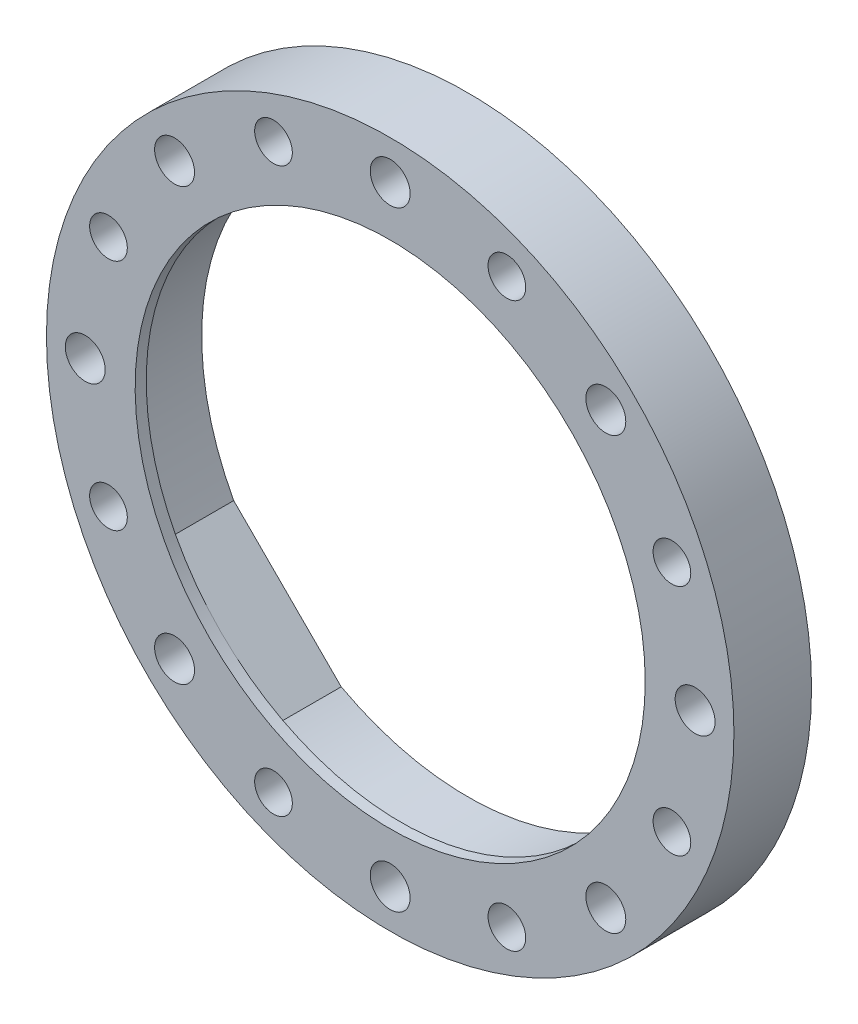
ISO-10303-21;
HEADER;
FILE_DESCRIPTION(('STEP AP214'),'2;1');
FILE_NAME('part.step','',(''),(''),'','','');
FILE_SCHEMA(('AUTOMOTIVE_DESIGN { 1 0 10303 214 1 1 1 1 }'));
ENDSEC;
DATA;
#1=APPLICATION_CONTEXT('core data for automotive mechanical design processes');
#2=APPLICATION_PROTOCOL_DEFINITION('international standard','automotive_design',2000,#1);
#3=PRODUCT_CONTEXT('',#1,'mechanical');
#4=PRODUCT('Part','Part','',(#3));
#5=PRODUCT_RELATED_PRODUCT_CATEGORY('part','',(#4));
#6=PRODUCT_DEFINITION_FORMATION('','',#4);
#7=PRODUCT_DEFINITION_CONTEXT('part definition',#1,'design');
#8=PRODUCT_DEFINITION('design','',#6,#7);
#9=PRODUCT_DEFINITION_SHAPE('','',#8);
#10=(LENGTH_UNIT() NAMED_UNIT(*) SI_UNIT(.MILLI.,.METRE.));
#11=(NAMED_UNIT(*) PLANE_ANGLE_UNIT() SI_UNIT($,.RADIAN.));
#12=(NAMED_UNIT(*) SI_UNIT($,.STERADIAN.) SOLID_ANGLE_UNIT());
#13=UNCERTAINTY_MEASURE_WITH_UNIT(LENGTH_MEASURE(1.E-05),#10,'distance_accuracy_value','');
#14=(GEOMETRIC_REPRESENTATION_CONTEXT(3) GLOBAL_UNCERTAINTY_ASSIGNED_CONTEXT((#13)) GLOBAL_UNIT_ASSIGNED_CONTEXT((#10,
#11,#12)) REPRESENTATION_CONTEXT('',''));
#15=CARTESIAN_POINT('',(0.,0.,0.));
#16=DIRECTION('',(0.,0.,1.));
#17=DIRECTION('',(1.,0.,0.));
#18=AXIS2_PLACEMENT_3D('',#15,#16,#17);
#19=CARTESIAN_POINT('',(0.,0.,0.));
#20=DIRECTION('',(0.,0.,1.));
#21=DIRECTION('',(1.,0.,0.));
#22=AXIS2_PLACEMENT_3D('',#19,#20,#21);
#23=CYLINDRICAL_SURFACE('',#22,24.);
#24=CARTESIAN_POINT('',(0.,0.,6.));
#25=DIRECTION('',(0.,0.,1.));
#26=DIRECTION('',(1.,0.,0.));
#27=AXIS2_PLACEMENT_3D('',#24,#25,#26);
#28=CIRCLE('',#27,24.);
#29=CARTESIAN_POINT('',(11.4157761098743,21.1111358247069,6.));
#30=VERTEX_POINT('',#29);
#31=CARTESIAN_POINT('',(-11.4157761098743,21.1111358247069,6.));
#32=VERTEX_POINT('',#31);
#33=EDGE_CURVE('E118',#30,#32,#28,.T.);
#34=ORIENTED_EDGE('',*,*,#33,.T.);
#35=DIRECTION('',(0.,0.,1.));
#36=VECTOR('',#35,1.);
#37=CARTESIAN_POINT('',(-11.4157761098743,21.1111358247069,0.));
#38=LINE('',#37,#36);
#39=CARTESIAN_POINT('',(-11.4157761098743,21.1111358247069,0.));
#40=VERTEX_POINT('',#39);
#41=EDGE_CURVE('E146',#40,#32,#38,.T.);
#42=ORIENTED_EDGE('',*,*,#41,.F.);
#43=CARTESIAN_POINT('',(0.,0.,0.));
#44=DIRECTION('',(0.,0.,1.));
#45=DIRECTION('',(1.,0.,0.));
#46=AXIS2_PLACEMENT_3D('',#43,#44,#45);
#47=CIRCLE('',#46,24.);
#48=CARTESIAN_POINT('',(11.4157761098743,21.1111358247069,0.));
#49=VERTEX_POINT('',#48);
#50=EDGE_CURVE('E190',#49,#40,#47,.T.);
#51=ORIENTED_EDGE('',*,*,#50,.F.);
#52=DIRECTION('',(0.,0.,1.));
#53=VECTOR('',#52,1.);
#54=CARTESIAN_POINT('',(11.4157761098743,21.1111358247069,0.));
#55=LINE('',#54,#53);
#56=EDGE_CURVE('E154',#49,#30,#55,.T.);
#57=ORIENTED_EDGE('',*,*,#56,.T.);
#58=EDGE_LOOP('',(#34,#42,#51,#57));
#59=FACE_BOUND('',#58,.T.);
#60=ADVANCED_FACE('F35',(#59),#23,.F.);
#61=CARTESIAN_POINT('',(21.1111358247069,-11.4157761098743,6.));
#62=VERTEX_POINT('',#61);
#63=CARTESIAN_POINT('',(21.1111358247069,11.4157761098743,6.));
#64=VERTEX_POINT('',#63);
#65=EDGE_CURVE('E187',#62,#64,#28,.T.);
#66=ORIENTED_EDGE('',*,*,#65,.T.);
#67=DIRECTION('',(0.,0.,1.));
#68=VECTOR('',#67,1.);
#69=CARTESIAN_POINT('',(21.1111358247069,11.4157761098743,0.));
#70=LINE('',#69,#68);
#71=CARTESIAN_POINT('',(21.1111358247069,11.4157761098743,0.));
#72=VERTEX_POINT('',#71);
#73=EDGE_CURVE('E144',#72,#64,#70,.T.);
#74=ORIENTED_EDGE('',*,*,#73,.F.);
#75=CARTESIAN_POINT('',(21.1111358247069,-11.4157761098742,0.));
#76=VERTEX_POINT('',#75);
#77=EDGE_CURVE('E183',#76,#72,#47,.T.);
#78=ORIENTED_EDGE('',*,*,#77,.F.);
#79=DIRECTION('',(0.,0.,1.));
#80=VECTOR('',#79,1.);
#81=CARTESIAN_POINT('',(21.1111358247069,-11.4157761098743,0.));
#82=LINE('',#81,#80);
#83=EDGE_CURVE('E163',#76,#62,#82,.T.);
#84=ORIENTED_EDGE('',*,*,#83,.T.);
#85=EDGE_LOOP('',(#66,#74,#78,#84));
#86=FACE_BOUND('',#85,.T.);
#87=ADVANCED_FACE('F200',(#86),#23,.F.);
#88=CARTESIAN_POINT('',(-21.1111358247069,11.4157761098743,0.));
#89=VERTEX_POINT('',#88);
#90=CARTESIAN_POINT('',(-21.1111358247069,-11.4157761098742,0.));
#91=VERTEX_POINT('',#90);
#92=EDGE_CURVE('E184',#89,#91,#47,.T.);
#93=ORIENTED_EDGE('',*,*,#92,.F.);
#94=DIRECTION('',(0.,0.,1.));
#95=VECTOR('',#94,1.);
#96=CARTESIAN_POINT('',(-21.1111358247069,11.4157761098743,0.));
#97=LINE('',#96,#95);
#98=CARTESIAN_POINT('',(-21.1111358247069,11.4157761098743,6.));
#99=VERTEX_POINT('',#98);
#100=EDGE_CURVE('E148',#89,#99,#97,.T.);
#101=ORIENTED_EDGE('',*,*,#100,.T.);
#102=CARTESIAN_POINT('',(-21.1111358247069,-11.4157761098742,6.));
#103=VERTEX_POINT('',#102);
#104=EDGE_CURVE('E179',#99,#103,#28,.T.);
#105=ORIENTED_EDGE('',*,*,#104,.T.);
#106=DIRECTION('',(0.,0.,1.));
#107=VECTOR('',#106,1.);
#108=CARTESIAN_POINT('',(-21.1111358247069,-11.4157761098743,0.));
#109=LINE('',#108,#107);
#110=EDGE_CURVE('E172',#91,#103,#109,.T.);
#111=ORIENTED_EDGE('',*,*,#110,.F.);
#112=EDGE_LOOP('',(#93,#101,#105,#111));
#113=FACE_BOUND('',#112,.T.);
#114=ADVANCED_FACE('F226',(#113),#23,.F.);
#115=DIRECTION('',(0.,0.,1.));
#116=VECTOR('',#115,1.);
#117=CARTESIAN_POINT('',(11.4157761098743,-21.1111358247069,0.));
#118=LINE('',#117,#116);
#119=CARTESIAN_POINT('',(11.4157761098743,-21.1111358247069,0.));
#120=VERTEX_POINT('',#119);
#121=CARTESIAN_POINT('',(11.4157761098743,-21.1111358247069,6.));
#122=VERTEX_POINT('',#121);
#123=EDGE_CURVE('E159',#120,#122,#118,.T.);
#124=ORIENTED_EDGE('',*,*,#123,.F.);
#125=CARTESIAN_POINT('',(-11.4157761098742,-21.1111358247069,0.));
#126=VERTEX_POINT('',#125);
#127=EDGE_CURVE('E43',#126,#120,#47,.T.);
#128=ORIENTED_EDGE('',*,*,#127,.F.);
#129=DIRECTION('',(0.,0.,1.));
#130=VECTOR('',#129,1.);
#131=CARTESIAN_POINT('',(-11.4157761098743,-21.1111358247069,0.));
#132=LINE('',#131,#130);
#133=CARTESIAN_POINT('',(-11.4157761098743,-21.1111358247069,6.));
#134=VERTEX_POINT('',#133);
#135=EDGE_CURVE('E176',#126,#134,#132,.T.);
#136=ORIENTED_EDGE('',*,*,#135,.T.);
#137=EDGE_CURVE('E185',#134,#122,#28,.T.);
#138=ORIENTED_EDGE('',*,*,#137,.T.);
#139=EDGE_LOOP('',(#124,#128,#136,#138));
#140=FACE_BOUND('',#139,.T.);
#141=ADVANCED_FACE('F205',(#140),#23,.F.);
#142=CARTESIAN_POINT('',(0.,0.,6.));
#143=DIRECTION('',(0.,0.,-1.));
#144=DIRECTION('',(-1.,0.,0.));
#145=AXIS2_PLACEMENT_3D('',#142,#143,#144);
#146=CYLINDRICAL_SURFACE('',#145,31.);
#147=CARTESIAN_POINT('',(0.,0.,0.));
#148=DIRECTION('',(0.,0.,1.));
#149=DIRECTION('',(1.,0.,0.));
#150=AXIS2_PLACEMENT_3D('',#147,#148,#149);
#151=CIRCLE('',#150,31.);
#152=CARTESIAN_POINT('',(31.,0.,0.));
#153=VERTEX_POINT('',#152);
#154=EDGE_CURVE('E11',#153,#153,#151,.T.);
#155=ORIENTED_EDGE('',*,*,#154,.T.);
#156=EDGE_LOOP('',(#155));
#157=FACE_BOUND('',#156,.T.);
#158=CARTESIAN_POINT('',(0.,0.,7.));
#159=DIRECTION('',(0.,0.,1.));
#160=DIRECTION('',(1.,0.,0.));
#161=AXIS2_PLACEMENT_3D('',#158,#159,#160);
#162=CIRCLE('',#161,31.);
#163=CARTESIAN_POINT('',(31.,0.,7.));
#164=VERTEX_POINT('',#163);
#165=EDGE_CURVE('E221',#164,#164,#162,.T.);
#166=ORIENTED_EDGE('',*,*,#165,.F.);
#167=EDGE_LOOP('',(#166));
#168=FACE_BOUND('',#167,.T.);
#169=ADVANCED_FACE('F37',(#157,#168),#146,.T.);
#170=CARTESIAN_POINT('',(0.,0.,0.));
#171=DIRECTION('',(0.,0.,1.));
#172=DIRECTION('',(1.,0.,0.));
#173=AXIS2_PLACEMENT_3D('',#170,#171,#172);
#174=PLANE('',#173);
#175=CARTESIAN_POINT('',(25.4066871440602,10.5237943900404,0.));
#176=DIRECTION('',(0.,0.,1.));
#177=DIRECTION('',(1.,0.,0.));
#178=AXIS2_PLACEMENT_3D('',#175,#176,#177);
#179=CIRCLE('',#178,1.7);
#180=CARTESIAN_POINT('',(27.1066871440602,10.5237943900404,0.));
#181=VERTEX_POINT('',#180);
#182=EDGE_CURVE('E341',#181,#181,#179,.T.);
#183=ORIENTED_EDGE('',*,*,#182,.T.);
#184=EDGE_LOOP('',(#183));
#185=FACE_BOUND('',#184,.T.);
#186=CARTESIAN_POINT('',(25.4066871440606,-10.5237943900395,0.));
#187=DIRECTION('',(0.,0.,1.));
#188=DIRECTION('',(1.,0.,0.));
#189=AXIS2_PLACEMENT_3D('',#186,#187,#188);
#190=CIRCLE('',#189,1.7);
#191=CARTESIAN_POINT('',(27.1066871440606,-10.5237943900395,0.));
#192=VERTEX_POINT('',#191);
#193=EDGE_CURVE('E351',#192,#192,#190,.T.);
#194=ORIENTED_EDGE('',*,*,#193,.T.);
#195=EDGE_LOOP('',(#194));
#196=FACE_BOUND('',#195,.T.);
#197=CARTESIAN_POINT('',(10.5237943900403,-25.4066871440602,0.));
#198=DIRECTION('',(0.,0.,1.));
#199=DIRECTION('',(1.,0.,0.));
#200=AXIS2_PLACEMENT_3D('',#197,#198,#199);
#201=CIRCLE('',#200,1.7);
#202=CARTESIAN_POINT('',(12.2237943900403,-25.4066871440602,0.));
#203=VERTEX_POINT('',#202);
#204=EDGE_CURVE('E357',#203,#203,#201,.T.);
#205=ORIENTED_EDGE('',*,*,#204,.T.);
#206=EDGE_LOOP('',(#205));
#207=FACE_BOUND('',#206,.T.);
#208=CARTESIAN_POINT('',(-10.5237943900398,-25.4066871440604,0.));
#209=DIRECTION('',(0.,0.,1.));
#210=DIRECTION('',(1.,0.,0.));
#211=AXIS2_PLACEMENT_3D('',#208,#209,#210);
#212=CIRCLE('',#211,1.7);
#213=CARTESIAN_POINT('',(-8.82379439003982,-25.4066871440604,0.));
#214=VERTEX_POINT('',#213);
#215=EDGE_CURVE('E363',#214,#214,#212,.T.);
#216=ORIENTED_EDGE('',*,*,#215,.T.);
#217=EDGE_LOOP('',(#216));
#218=FACE_BOUND('',#217,.T.);
#219=CARTESIAN_POINT('',(-25.4066871440603,-10.5237943900403,0.));
#220=DIRECTION('',(0.,0.,1.));
#221=DIRECTION('',(1.,0.,0.));
#222=AXIS2_PLACEMENT_3D('',#219,#220,#221);
#223=CIRCLE('',#222,1.7);
#224=CARTESIAN_POINT('',(-23.7066871440603,-10.5237943900403,0.));
#225=VERTEX_POINT('',#224);
#226=EDGE_CURVE('E369',#225,#225,#223,.T.);
#227=ORIENTED_EDGE('',*,*,#226,.T.);
#228=EDGE_LOOP('',(#227));
#229=FACE_BOUND('',#228,.T.);
#230=CARTESIAN_POINT('',(-25.4066871440605,10.5237943900397,0.));
#231=DIRECTION('',(0.,0.,1.));
#232=DIRECTION('',(1.,0.,0.));
#233=AXIS2_PLACEMENT_3D('',#230,#231,#232);
#234=CIRCLE('',#233,1.7);
#235=CARTESIAN_POINT('',(-23.7066871440605,10.5237943900397,0.));
#236=VERTEX_POINT('',#235);
#237=EDGE_CURVE('E375',#236,#236,#234,.T.);
#238=ORIENTED_EDGE('',*,*,#237,.T.);
#239=EDGE_LOOP('',(#238));
#240=FACE_BOUND('',#239,.T.);
#241=CARTESIAN_POINT('',(-10.5237943900402,25.4066871440603,0.));
#242=DIRECTION('',(0.,0.,1.));
#243=DIRECTION('',(1.,0.,0.));
#244=AXIS2_PLACEMENT_3D('',#241,#242,#243);
#245=CIRCLE('',#244,1.7);
#246=CARTESIAN_POINT('',(-8.82379439004017,25.4066871440603,0.));
#247=VERTEX_POINT('',#246);
#248=EDGE_CURVE('E381',#247,#247,#245,.T.);
#249=ORIENTED_EDGE('',*,*,#248,.T.);
#250=EDGE_LOOP('',(#249));
#251=FACE_BOUND('',#250,.T.);
#252=CARTESIAN_POINT('',(10.5237943900398,25.4066871440604,0.));
#253=DIRECTION('',(0.,0.,1.));
#254=DIRECTION('',(1.,0.,0.));
#255=AXIS2_PLACEMENT_3D('',#252,#253,#254);
#256=CIRCLE('',#255,1.7);
#257=CARTESIAN_POINT('',(12.2237943900398,25.4066871440604,0.));
#258=VERTEX_POINT('',#257);
#259=EDGE_CURVE('E387',#258,#258,#256,.T.);
#260=ORIENTED_EDGE('',*,*,#259,.T.);
#261=EDGE_LOOP('',(#260));
#262=FACE_BOUND('',#261,.T.);
#263=CARTESIAN_POINT('',(19.4454364826298,19.4454364826303,0.));
#264=DIRECTION('',(0.,0.,1.));
#265=DIRECTION('',(1.,0.,0.));
#266=AXIS2_PLACEMENT_3D('',#263,#264,#265);
#267=CIRCLE('',#266,1.8);
#268=CARTESIAN_POINT('',(21.2454364826298,19.4454364826303,0.));
#269=VERTEX_POINT('',#268);
#270=EDGE_CURVE('E393',#269,#269,#267,.T.);
#271=ORIENTED_EDGE('',*,*,#270,.T.);
#272=EDGE_LOOP('',(#271));
#273=FACE_BOUND('',#272,.T.);
#274=CARTESIAN_POINT('',(27.5,2.88047210454558E-13,0.));
#275=DIRECTION('',(0.,0.,1.));
#276=DIRECTION('',(1.,0.,0.));
#277=AXIS2_PLACEMENT_3D('',#274,#275,#276);
#278=CIRCLE('',#277,1.8);
#279=CARTESIAN_POINT('',(29.3,2.88047210454558E-13,0.));
#280=VERTEX_POINT('',#279);
#281=EDGE_CURVE('E399',#280,#280,#278,.T.);
#282=ORIENTED_EDGE('',*,*,#281,.T.);
#283=EDGE_LOOP('',(#282));
#284=FACE_BOUND('',#283,.T.);
#285=CARTESIAN_POINT('',(19.4454364826302,-19.4454364826299,0.));
#286=DIRECTION('',(0.,0.,1.));
#287=DIRECTION('',(1.,0.,0.));
#288=AXIS2_PLACEMENT_3D('',#285,#286,#287);
#289=CIRCLE('',#288,1.8);
#290=CARTESIAN_POINT('',(21.2454364826302,-19.4454364826299,0.));
#291=VERTEX_POINT('',#290);
#292=EDGE_CURVE('E405',#291,#291,#289,.T.);
#293=ORIENTED_EDGE('',*,*,#292,.T.);
#294=EDGE_LOOP('',(#293));
#295=FACE_BOUND('',#294,.T.);
#296=CARTESIAN_POINT('',(0.,-27.5,0.));
#297=DIRECTION('',(0.,0.,1.));
#298=DIRECTION('',(1.,0.,0.));
#299=AXIS2_PLACEMENT_3D('',#296,#297,#298);
#300=CIRCLE('',#299,1.8);
#301=CARTESIAN_POINT('',(1.8,-27.5,0.));
#302=VERTEX_POINT('',#301);
#303=EDGE_CURVE('E411',#302,#302,#300,.T.);
#304=ORIENTED_EDGE('',*,*,#303,.T.);
#305=EDGE_LOOP('',(#304));
#306=FACE_BOUND('',#305,.T.);
#307=CARTESIAN_POINT('',(-19.44543648263,-19.4454364826302,0.));
#308=DIRECTION('',(0.,0.,1.));
#309=DIRECTION('',(1.,0.,0.));
#310=AXIS2_PLACEMENT_3D('',#307,#308,#309);
#311=CIRCLE('',#310,1.8);
#312=CARTESIAN_POINT('',(-17.64543648263,-19.4454364826302,0.));
#313=VERTEX_POINT('',#312);
#314=EDGE_CURVE('E417',#313,#313,#311,.T.);
#315=ORIENTED_EDGE('',*,*,#314,.T.);
#316=EDGE_LOOP('',(#315));
#317=FACE_BOUND('',#316,.T.);
#318=CARTESIAN_POINT('',(-27.5,0.,0.));
#319=DIRECTION('',(0.,0.,1.));
#320=DIRECTION('',(1.,0.,0.));
#321=AXIS2_PLACEMENT_3D('',#318,#319,#320);
#322=CIRCLE('',#321,1.8);
#323=CARTESIAN_POINT('',(-25.7,0.,0.));
#324=VERTEX_POINT('',#323);
#325=EDGE_CURVE('E423',#324,#324,#322,.T.);
#326=ORIENTED_EDGE('',*,*,#325,.T.);
#327=EDGE_LOOP('',(#326));
#328=FACE_BOUND('',#327,.T.);
#329=CARTESIAN_POINT('',(-19.4454364826301,19.44543648263,0.));
#330=DIRECTION('',(0.,0.,1.));
#331=DIRECTION('',(1.,0.,0.));
#332=AXIS2_PLACEMENT_3D('',#329,#330,#331);
#333=CIRCLE('',#332,1.8);
#334=CARTESIAN_POINT('',(-17.6454364826301,19.44543648263,0.));
#335=VERTEX_POINT('',#334);
#336=EDGE_CURVE('E429',#335,#335,#333,.T.);
#337=ORIENTED_EDGE('',*,*,#336,.T.);
#338=EDGE_LOOP('',(#337));
#339=FACE_BOUND('',#338,.T.);
#340=CARTESIAN_POINT('',(0.,27.5,0.));
#341=DIRECTION('',(0.,0.,1.));
#342=DIRECTION('',(1.,0.,0.));
#343=AXIS2_PLACEMENT_3D('',#340,#341,#342);
#344=CIRCLE('',#343,1.8);
#345=CARTESIAN_POINT('',(1.8,27.5,0.));
#346=VERTEX_POINT('',#345);
#347=EDGE_CURVE('E135',#346,#346,#344,.T.);
#348=ORIENTED_EDGE('',*,*,#347,.T.);
#349=EDGE_LOOP('',(#348));
#350=FACE_BOUND('',#349,.T.);
#351=ORIENTED_EDGE('',*,*,#127,.T.);
#352=DIRECTION('',(0.707106781186548,0.707106781186548,0.));
#353=VECTOR('',#352,1.);
#354=CARTESIAN_POINT('',(16.2634559672906,-16.2634559672906,0.));
#355=LINE('',#354,#353);
#356=EDGE_CURVE('E156',#120,#76,#355,.T.);
#357=ORIENTED_EDGE('',*,*,#356,.T.);
#358=ORIENTED_EDGE('',*,*,#77,.T.);
#359=DIRECTION('',(0.707106781186548,-0.707106781186548,0.));
#360=VECTOR('',#359,1.);
#361=CARTESIAN_POINT('',(16.2634559672906,16.2634559672906,0.));
#362=LINE('',#361,#360);
#363=EDGE_CURVE('E56',#49,#72,#362,.T.);
#364=ORIENTED_EDGE('',*,*,#363,.F.);
#365=ORIENTED_EDGE('',*,*,#50,.T.);
#366=DIRECTION('',(0.707106781186548,0.707106781186548,0.));
#367=VECTOR('',#366,1.);
#368=CARTESIAN_POINT('',(-16.2634559672906,16.2634559672906,0.));
#369=LINE('',#368,#367);
#370=EDGE_CURVE('E50',#89,#40,#369,.T.);
#371=ORIENTED_EDGE('',*,*,#370,.F.);
#372=ORIENTED_EDGE('',*,*,#92,.T.);
#373=DIRECTION('',(0.707106781186548,-0.707106781186548,0.));
#374=VECTOR('',#373,1.);
#375=CARTESIAN_POINT('',(-16.2634559672906,-16.2634559672906,0.));
#376=LINE('',#375,#374);
#377=EDGE_CURVE('E169',#91,#126,#376,.T.);
#378=ORIENTED_EDGE('',*,*,#377,.T.);
#379=EDGE_LOOP('',(#351,#357,#358,#364,#365,#371,#372,#378));
#380=FACE_BOUND('',#379,.T.);
#381=ORIENTED_EDGE('',*,*,#154,.F.);
#382=EDGE_LOOP('',(#381));
#383=FACE_BOUND('',#382,.T.);
#384=ADVANCED_FACE('F201',(#185,#196,#207,#218,#229,#240,#251,#262,#273,#284,#295,#306,#317,
#328,#339,#350,#380,#383),#174,.F.);
#385=CARTESIAN_POINT('',(-16.2634559672906,-16.2634559672906,0.));
#386=DIRECTION('',(-0.707106781186547,-0.707106781186547,0.));
#387=DIRECTION('',(0.707106781186548,-0.707106781186548,0.));
#388=AXIS2_PLACEMENT_3D('',#385,#386,#387);
#389=PLANE('',#388);
#390=DIRECTION('',(0.707106781186548,-0.707106781186548,0.));
#391=VECTOR('',#390,1.);
#392=CARTESIAN_POINT('',(-16.2634559672906,-16.2634559672906,6.));
#393=LINE('',#392,#391);
#394=CARTESIAN_POINT('',(-16.2634559672906,-16.2634559672906,6.));
#395=VERTEX_POINT('',#394);
#396=EDGE_CURVE('E173',#103,#395,#393,.T.);
#397=ORIENTED_EDGE('',*,*,#396,.T.);
#398=EDGE_CURVE('E166',#395,#134,#393,.T.);
#399=ORIENTED_EDGE('',*,*,#398,.T.);
#400=ORIENTED_EDGE('',*,*,#135,.F.);
#401=ORIENTED_EDGE('',*,*,#377,.F.);
#402=ORIENTED_EDGE('',*,*,#110,.T.);
#403=EDGE_LOOP('',(#397,#399,#400,#401,#402));
#404=FACE_BOUND('',#403,.T.);
#405=ADVANCED_FACE('F211',(#404),#389,.F.);
#406=CARTESIAN_POINT('',(16.2634559672906,-16.2634559672906,0.));
#407=DIRECTION('',(0.707106781186547,-0.707106781186547,0.));
#408=DIRECTION('',(0.707106781186548,0.707106781186548,0.));
#409=AXIS2_PLACEMENT_3D('',#406,#407,#408);
#410=PLANE('',#409);
#411=DIRECTION('',(0.707106781186548,0.707106781186548,0.));
#412=VECTOR('',#411,1.);
#413=CARTESIAN_POINT('',(16.2634559672906,-16.2634559672906,6.));
#414=LINE('',#413,#412);
#415=CARTESIAN_POINT('',(16.2634559672906,-16.2634559672906,6.));
#416=VERTEX_POINT('',#415);
#417=EDGE_CURVE('E160',#122,#416,#414,.T.);
#418=ORIENTED_EDGE('',*,*,#417,.T.);
#419=EDGE_CURVE('E130',#416,#62,#414,.T.);
#420=ORIENTED_EDGE('',*,*,#419,.T.);
#421=ORIENTED_EDGE('',*,*,#83,.F.);
#422=ORIENTED_EDGE('',*,*,#356,.F.);
#423=ORIENTED_EDGE('',*,*,#123,.T.);
#424=EDGE_LOOP('',(#418,#420,#421,#422,#423));
#425=FACE_BOUND('',#424,.T.);
#426=ADVANCED_FACE('F204',(#425),#410,.F.);
#427=CARTESIAN_POINT('',(16.2634559672906,16.2634559672906,0.));
#428=DIRECTION('',(-0.707106781186547,-0.707106781186547,0.));
#429=DIRECTION('',(0.707106781186548,-0.707106781186548,0.));
#430=AXIS2_PLACEMENT_3D('',#427,#428,#429);
#431=PLANE('',#430);
#432=DIRECTION('',(0.707106781186548,-0.707106781186548,0.));
#433=VECTOR('',#432,1.);
#434=CARTESIAN_POINT('',(16.2634559672906,16.2634559672906,6.));
#435=LINE('',#434,#433);
#436=CARTESIAN_POINT('',(16.2634559672906,16.2634559672906,6.));
#437=VERTEX_POINT('',#436);
#438=EDGE_CURVE('E111',#30,#437,#435,.T.);
#439=ORIENTED_EDGE('',*,*,#438,.F.);
#440=ORIENTED_EDGE('',*,*,#56,.F.);
#441=ORIENTED_EDGE('',*,*,#363,.T.);
#442=ORIENTED_EDGE('',*,*,#73,.T.);
#443=EDGE_CURVE('E122',#437,#64,#435,.T.);
#444=ORIENTED_EDGE('',*,*,#443,.F.);
#445=EDGE_LOOP('',(#439,#440,#441,#442,#444));
#446=FACE_BOUND('',#445,.T.);
#447=ADVANCED_FACE('F142',(#446),#431,.T.);
#448=CARTESIAN_POINT('',(-16.2634559672906,16.2634559672906,0.));
#449=DIRECTION('',(0.707106781186547,-0.707106781186547,0.));
#450=DIRECTION('',(0.707106781186548,0.707106781186548,0.));
#451=AXIS2_PLACEMENT_3D('',#448,#449,#450);
#452=PLANE('',#451);
#453=DIRECTION('',(0.707106781186548,0.707106781186548,0.));
#454=VECTOR('',#453,1.);
#455=CARTESIAN_POINT('',(-16.2634559672906,16.2634559672906,6.));
#456=LINE('',#455,#454);
#457=CARTESIAN_POINT('',(-16.2634559672906,16.2634559672906,6.));
#458=VERTEX_POINT('',#457);
#459=EDGE_CURVE('E217',#99,#458,#456,.T.);
#460=ORIENTED_EDGE('',*,*,#459,.F.);
#461=ORIENTED_EDGE('',*,*,#100,.F.);
#462=ORIENTED_EDGE('',*,*,#370,.T.);
#463=ORIENTED_EDGE('',*,*,#41,.T.);
#464=EDGE_CURVE('E224',#458,#32,#456,.T.);
#465=ORIENTED_EDGE('',*,*,#464,.F.);
#466=EDGE_LOOP('',(#460,#461,#462,#463,#465));
#467=FACE_BOUND('',#466,.T.);
#468=ADVANCED_FACE('F228',(#467),#452,.T.);
#469=CARTESIAN_POINT('',(0.,0.,6.));
#470=DIRECTION('',(0.,0.,1.));
#471=DIRECTION('',(1.,0.,0.));
#472=AXIS2_PLACEMENT_3D('',#469,#470,#471);
#473=PLANE('',#472);
#474=ORIENTED_EDGE('',*,*,#398,.F.);
#475=CARTESIAN_POINT('',(0.,0.,6.));
#476=DIRECTION('',(0.,0.,1.));
#477=DIRECTION('',(1.,0.,0.));
#478=AXIS2_PLACEMENT_3D('',#475,#476,#477);
#479=CIRCLE('',#478,23.);
#480=EDGE_CURVE('E134',#395,#416,#479,.T.);
#481=ORIENTED_EDGE('',*,*,#480,.T.);
#482=ORIENTED_EDGE('',*,*,#417,.F.);
#483=ORIENTED_EDGE('',*,*,#137,.F.);
#484=EDGE_LOOP('',(#474,#481,#482,#483));
#485=FACE_BOUND('',#484,.T.);
#486=ADVANCED_FACE('F213',(#485),#473,.F.);
#487=ORIENTED_EDGE('',*,*,#396,.F.);
#488=ORIENTED_EDGE('',*,*,#104,.F.);
#489=ORIENTED_EDGE('',*,*,#459,.T.);
#490=EDGE_CURVE('E140',#458,#395,#479,.T.);
#491=ORIENTED_EDGE('',*,*,#490,.T.);
#492=EDGE_LOOP('',(#487,#488,#489,#491));
#493=FACE_BOUND('',#492,.T.);
#494=ADVANCED_FACE('F215',(#493),#473,.F.);
#495=EDGE_CURVE('E115',#437,#458,#479,.T.);
#496=ORIENTED_EDGE('',*,*,#495,.T.);
#497=ORIENTED_EDGE('',*,*,#464,.T.);
#498=ORIENTED_EDGE('',*,*,#33,.F.);
#499=ORIENTED_EDGE('',*,*,#438,.T.);
#500=EDGE_LOOP('',(#496,#497,#498,#499));
#501=FACE_BOUND('',#500,.T.);
#502=ADVANCED_FACE('F113',(#501),#473,.F.);
#503=CARTESIAN_POINT('',(0.,0.,7.));
#504=DIRECTION('',(0.,0.,1.));
#505=DIRECTION('',(1.,0.,0.));
#506=AXIS2_PLACEMENT_3D('',#503,#504,#505);
#507=PLANE('',#506);
#508=CARTESIAN_POINT('',(25.4066871440602,10.5237943900404,7.));
#509=DIRECTION('',(0.,0.,1.));
#510=DIRECTION('',(1.,0.,0.));
#511=AXIS2_PLACEMENT_3D('',#508,#509,#510);
#512=CIRCLE('',#511,1.7);
#513=CARTESIAN_POINT('',(27.1066871440602,10.5237943900404,7.));
#514=VERTEX_POINT('',#513);
#515=EDGE_CURVE('E344',#514,#514,#512,.T.);
#516=ORIENTED_EDGE('',*,*,#515,.F.);
#517=EDGE_LOOP('',(#516));
#518=FACE_BOUND('',#517,.T.);
#519=CARTESIAN_POINT('',(25.4066871440606,-10.5237943900395,7.));
#520=DIRECTION('',(0.,0.,1.));
#521=DIRECTION('',(1.,0.,0.));
#522=AXIS2_PLACEMENT_3D('',#519,#520,#521);
#523=CIRCLE('',#522,1.7);
#524=CARTESIAN_POINT('',(27.1066871440606,-10.5237943900395,7.));
#525=VERTEX_POINT('',#524);
#526=EDGE_CURVE('E346',#525,#525,#523,.T.);
#527=ORIENTED_EDGE('',*,*,#526,.F.);
#528=EDGE_LOOP('',(#527));
#529=FACE_BOUND('',#528,.T.);
#530=CARTESIAN_POINT('',(10.5237943900403,-25.4066871440602,7.));
#531=DIRECTION('',(0.,0.,1.));
#532=DIRECTION('',(1.,0.,0.));
#533=AXIS2_PLACEMENT_3D('',#530,#531,#532);
#534=CIRCLE('',#533,1.7);
#535=CARTESIAN_POINT('',(12.2237943900403,-25.4066871440602,7.));
#536=VERTEX_POINT('',#535);
#537=EDGE_CURVE('E354',#536,#536,#534,.T.);
#538=ORIENTED_EDGE('',*,*,#537,.F.);
#539=EDGE_LOOP('',(#538));
#540=FACE_BOUND('',#539,.T.);
#541=CARTESIAN_POINT('',(-10.5237943900398,-25.4066871440604,7.));
#542=DIRECTION('',(0.,0.,1.));
#543=DIRECTION('',(1.,0.,0.));
#544=AXIS2_PLACEMENT_3D('',#541,#542,#543);
#545=CIRCLE('',#544,1.7);
#546=CARTESIAN_POINT('',(-8.82379439003982,-25.4066871440604,7.));
#547=VERTEX_POINT('',#546);
#548=EDGE_CURVE('E360',#547,#547,#545,.T.);
#549=ORIENTED_EDGE('',*,*,#548,.F.);
#550=EDGE_LOOP('',(#549));
#551=FACE_BOUND('',#550,.T.);
#552=CARTESIAN_POINT('',(-25.4066871440603,-10.5237943900403,7.));
#553=DIRECTION('',(0.,0.,1.));
#554=DIRECTION('',(1.,0.,0.));
#555=AXIS2_PLACEMENT_3D('',#552,#553,#554);
#556=CIRCLE('',#555,1.7);
#557=CARTESIAN_POINT('',(-23.7066871440603,-10.5237943900403,7.));
#558=VERTEX_POINT('',#557);
#559=EDGE_CURVE('E366',#558,#558,#556,.T.);
#560=ORIENTED_EDGE('',*,*,#559,.F.);
#561=EDGE_LOOP('',(#560));
#562=FACE_BOUND('',#561,.T.);
#563=CARTESIAN_POINT('',(-25.4066871440605,10.5237943900397,7.));
#564=DIRECTION('',(0.,0.,1.));
#565=DIRECTION('',(1.,0.,0.));
#566=AXIS2_PLACEMENT_3D('',#563,#564,#565);
#567=CIRCLE('',#566,1.7);
#568=CARTESIAN_POINT('',(-23.7066871440605,10.5237943900397,7.));
#569=VERTEX_POINT('',#568);
#570=EDGE_CURVE('E372',#569,#569,#567,.T.);
#571=ORIENTED_EDGE('',*,*,#570,.F.);
#572=EDGE_LOOP('',(#571));
#573=FACE_BOUND('',#572,.T.);
#574=CARTESIAN_POINT('',(-10.5237943900402,25.4066871440603,7.));
#575=DIRECTION('',(0.,0.,1.));
#576=DIRECTION('',(1.,0.,0.));
#577=AXIS2_PLACEMENT_3D('',#574,#575,#576);
#578=CIRCLE('',#577,1.7);
#579=CARTESIAN_POINT('',(-8.82379439004017,25.4066871440603,7.));
#580=VERTEX_POINT('',#579);
#581=EDGE_CURVE('E378',#580,#580,#578,.T.);
#582=ORIENTED_EDGE('',*,*,#581,.F.);
#583=EDGE_LOOP('',(#582));
#584=FACE_BOUND('',#583,.T.);
#585=CARTESIAN_POINT('',(10.5237943900398,25.4066871440604,7.));
#586=DIRECTION('',(0.,0.,1.));
#587=DIRECTION('',(1.,0.,0.));
#588=AXIS2_PLACEMENT_3D('',#585,#586,#587);
#589=CIRCLE('',#588,1.7);
#590=CARTESIAN_POINT('',(12.2237943900398,25.4066871440604,7.));
#591=VERTEX_POINT('',#590);
#592=EDGE_CURVE('E384',#591,#591,#589,.T.);
#593=ORIENTED_EDGE('',*,*,#592,.F.);
#594=EDGE_LOOP('',(#593));
#595=FACE_BOUND('',#594,.T.);
#596=CARTESIAN_POINT('',(19.4454364826298,19.4454364826303,7.));
#597=DIRECTION('',(0.,0.,1.));
#598=DIRECTION('',(1.,0.,0.));
#599=AXIS2_PLACEMENT_3D('',#596,#597,#598);
#600=CIRCLE('',#599,1.79999999999999);
#601=CARTESIAN_POINT('',(21.2454364826298,19.4454364826303,7.));
#602=VERTEX_POINT('',#601);
#603=EDGE_CURVE('E390',#602,#602,#600,.T.);
#604=ORIENTED_EDGE('',*,*,#603,.F.);
#605=EDGE_LOOP('',(#604));
#606=FACE_BOUND('',#605,.T.);
#607=CARTESIAN_POINT('',(27.5,2.88047210454558E-13,7.));
#608=DIRECTION('',(0.,0.,1.));
#609=DIRECTION('',(1.,0.,0.));
#610=AXIS2_PLACEMENT_3D('',#607,#608,#609);
#611=CIRCLE('',#610,1.79999999999999);
#612=CARTESIAN_POINT('',(29.3,2.88047210454558E-13,7.));
#613=VERTEX_POINT('',#612);
#614=EDGE_CURVE('E396',#613,#613,#611,.T.);
#615=ORIENTED_EDGE('',*,*,#614,.F.);
#616=EDGE_LOOP('',(#615));
#617=FACE_BOUND('',#616,.T.);
#618=CARTESIAN_POINT('',(19.4454364826302,-19.4454364826299,7.));
#619=DIRECTION('',(0.,0.,1.));
#620=DIRECTION('',(1.,0.,0.));
#621=AXIS2_PLACEMENT_3D('',#618,#619,#620);
#622=CIRCLE('',#621,1.79999999999999);
#623=CARTESIAN_POINT('',(21.2454364826302,-19.4454364826299,7.));
#624=VERTEX_POINT('',#623);
#625=EDGE_CURVE('E402',#624,#624,#622,.T.);
#626=ORIENTED_EDGE('',*,*,#625,.F.);
#627=EDGE_LOOP('',(#626));
#628=FACE_BOUND('',#627,.T.);
#629=CARTESIAN_POINT('',(0.,-27.5,7.));
#630=DIRECTION('',(0.,0.,1.));
#631=DIRECTION('',(1.,0.,0.));
#632=AXIS2_PLACEMENT_3D('',#629,#630,#631);
#633=CIRCLE('',#632,1.79999999999999);
#634=CARTESIAN_POINT('',(1.79999999999999,-27.5,7.));
#635=VERTEX_POINT('',#634);
#636=EDGE_CURVE('E408',#635,#635,#633,.T.);
#637=ORIENTED_EDGE('',*,*,#636,.F.);
#638=EDGE_LOOP('',(#637));
#639=FACE_BOUND('',#638,.T.);
#640=CARTESIAN_POINT('',(-19.44543648263,-19.4454364826302,7.));
#641=DIRECTION('',(0.,0.,1.));
#642=DIRECTION('',(1.,0.,0.));
#643=AXIS2_PLACEMENT_3D('',#640,#641,#642);
#644=CIRCLE('',#643,1.79999999999999);
#645=CARTESIAN_POINT('',(-17.64543648263,-19.4454364826302,7.));
#646=VERTEX_POINT('',#645);
#647=EDGE_CURVE('E414',#646,#646,#644,.T.);
#648=ORIENTED_EDGE('',*,*,#647,.F.);
#649=EDGE_LOOP('',(#648));
#650=FACE_BOUND('',#649,.T.);
#651=CARTESIAN_POINT('',(-27.5,0.,7.));
#652=DIRECTION('',(0.,0.,1.));
#653=DIRECTION('',(1.,0.,0.));
#654=AXIS2_PLACEMENT_3D('',#651,#652,#653);
#655=CIRCLE('',#654,1.79999999999999);
#656=CARTESIAN_POINT('',(-25.7,0.,7.));
#657=VERTEX_POINT('',#656);
#658=EDGE_CURVE('E420',#657,#657,#655,.T.);
#659=ORIENTED_EDGE('',*,*,#658,.F.);
#660=EDGE_LOOP('',(#659));
#661=FACE_BOUND('',#660,.T.);
#662=CARTESIAN_POINT('',(-19.4454364826301,19.44543648263,7.));
#663=DIRECTION('',(0.,0.,1.));
#664=DIRECTION('',(1.,0.,0.));
#665=AXIS2_PLACEMENT_3D('',#662,#663,#664);
#666=CIRCLE('',#665,1.79999999999999);
#667=CARTESIAN_POINT('',(-17.6454364826301,19.44543648263,7.));
#668=VERTEX_POINT('',#667);
#669=EDGE_CURVE('E426',#668,#668,#666,.T.);
#670=ORIENTED_EDGE('',*,*,#669,.F.);
#671=EDGE_LOOP('',(#670));
#672=FACE_BOUND('',#671,.T.);
#673=CARTESIAN_POINT('',(0.,27.5,7.));
#674=DIRECTION('',(0.,0.,1.));
#675=DIRECTION('',(1.,0.,0.));
#676=AXIS2_PLACEMENT_3D('',#673,#674,#675);
#677=CIRCLE('',#676,1.79999999999999);
#678=CARTESIAN_POINT('',(1.79999999999999,27.5,7.));
#679=VERTEX_POINT('',#678);
#680=EDGE_CURVE('E432',#679,#679,#677,.T.);
#681=ORIENTED_EDGE('',*,*,#680,.F.);
#682=EDGE_LOOP('',(#681));
#683=FACE_BOUND('',#682,.T.);
#684=ORIENTED_EDGE('',*,*,#165,.T.);
#685=EDGE_LOOP('',(#684));
#686=FACE_BOUND('',#685,.T.);
#687=CARTESIAN_POINT('',(0.,0.,7.));
#688=DIRECTION('',(0.,0.,1.));
#689=DIRECTION('',(1.,0.,0.));
#690=AXIS2_PLACEMENT_3D('',#687,#688,#689);
#691=CIRCLE('',#690,23.);
#692=CARTESIAN_POINT('',(23.,0.,7.));
#693=VERTEX_POINT('',#692);
#694=EDGE_CURVE('E141',#693,#693,#691,.T.);
#695=ORIENTED_EDGE('',*,*,#694,.F.);
#696=EDGE_LOOP('',(#695));
#697=FACE_BOUND('',#696,.T.);
#698=ADVANCED_FACE('F259',(#518,#529,#540,#551,#562,#573,#584,#595,#606,#617,#628,#639,#650,
#661,#672,#683,#686,#697),#507,.T.);
#699=EDGE_CURVE('E126',#416,#437,#479,.T.);
#700=ORIENTED_EDGE('',*,*,#699,.T.);
#701=ORIENTED_EDGE('',*,*,#443,.T.);
#702=ORIENTED_EDGE('',*,*,#65,.F.);
#703=ORIENTED_EDGE('',*,*,#419,.F.);
#704=EDGE_LOOP('',(#700,#701,#702,#703));
#705=FACE_BOUND('',#704,.T.);
#706=ADVANCED_FACE('F127',(#705),#473,.F.);
#707=CARTESIAN_POINT('',(0.,0.,7.));
#708=DIRECTION('',(0.,0.,-1.));
#709=DIRECTION('',(-1.,0.,0.));
#710=AXIS2_PLACEMENT_3D('',#707,#708,#709);
#711=CYLINDRICAL_SURFACE('',#710,23.);
#712=ORIENTED_EDGE('',*,*,#694,.T.);
#713=EDGE_LOOP('',(#712));
#714=FACE_BOUND('',#713,.T.);
#715=ORIENTED_EDGE('',*,*,#495,.F.);
#716=ORIENTED_EDGE('',*,*,#699,.F.);
#717=ORIENTED_EDGE('',*,*,#480,.F.);
#718=ORIENTED_EDGE('',*,*,#490,.F.);
#719=EDGE_LOOP('',(#715,#716,#717,#718));
#720=FACE_BOUND('',#719,.T.);
#721=ADVANCED_FACE('F138',(#714,#720),#711,.F.);
#722=CARTESIAN_POINT('',(0.,27.5,7.));
#723=DIRECTION('',(0.,0.,1.));
#724=DIRECTION('',(1.,0.,0.));
#725=AXIS2_PLACEMENT_3D('',#722,#723,#724);
#726=CYLINDRICAL_SURFACE('',#725,1.79999999999999);
#727=ORIENTED_EDGE('',*,*,#347,.F.);
#728=EDGE_LOOP('',(#727));
#729=FACE_BOUND('',#728,.T.);
#730=ORIENTED_EDGE('',*,*,#680,.T.);
#731=EDGE_LOOP('',(#730));
#732=FACE_BOUND('',#731,.T.);
#733=ADVANCED_FACE('F268',(#729,#732),#726,.F.);
#734=CARTESIAN_POINT('',(-19.4454364826301,19.44543648263,7.));
#735=DIRECTION('',(0.,0.,1.));
#736=DIRECTION('',(1.,0.,0.));
#737=AXIS2_PLACEMENT_3D('',#734,#735,#736);
#738=CYLINDRICAL_SURFACE('',#737,1.79999999999999);
#739=ORIENTED_EDGE('',*,*,#336,.F.);
#740=EDGE_LOOP('',(#739));
#741=FACE_BOUND('',#740,.T.);
#742=ORIENTED_EDGE('',*,*,#669,.T.);
#743=EDGE_LOOP('',(#742));
#744=FACE_BOUND('',#743,.T.);
#745=ADVANCED_FACE('F274',(#741,#744),#738,.F.);
#746=CARTESIAN_POINT('',(-27.5,0.,7.));
#747=DIRECTION('',(0.,0.,1.));
#748=DIRECTION('',(1.,0.,0.));
#749=AXIS2_PLACEMENT_3D('',#746,#747,#748);
#750=CYLINDRICAL_SURFACE('',#749,1.79999999999999);
#751=ORIENTED_EDGE('',*,*,#325,.F.);
#752=EDGE_LOOP('',(#751));
#753=FACE_BOUND('',#752,.T.);
#754=ORIENTED_EDGE('',*,*,#658,.T.);
#755=EDGE_LOOP('',(#754));
#756=FACE_BOUND('',#755,.T.);
#757=ADVANCED_FACE('F280',(#753,#756),#750,.F.);
#758=CARTESIAN_POINT('',(-19.44543648263,-19.4454364826302,7.));
#759=DIRECTION('',(0.,0.,1.));
#760=DIRECTION('',(1.,0.,0.));
#761=AXIS2_PLACEMENT_3D('',#758,#759,#760);
#762=CYLINDRICAL_SURFACE('',#761,1.79999999999999);
#763=ORIENTED_EDGE('',*,*,#314,.F.);
#764=EDGE_LOOP('',(#763));
#765=FACE_BOUND('',#764,.T.);
#766=ORIENTED_EDGE('',*,*,#647,.T.);
#767=EDGE_LOOP('',(#766));
#768=FACE_BOUND('',#767,.T.);
#769=ADVANCED_FACE('F284',(#765,#768),#762,.F.);
#770=CARTESIAN_POINT('',(0.,-27.5,7.));
#771=DIRECTION('',(0.,0.,1.));
#772=DIRECTION('',(1.,0.,0.));
#773=AXIS2_PLACEMENT_3D('',#770,#771,#772);
#774=CYLINDRICAL_SURFACE('',#773,1.79999999999999);
#775=ORIENTED_EDGE('',*,*,#303,.F.);
#776=EDGE_LOOP('',(#775));
#777=FACE_BOUND('',#776,.T.);
#778=ORIENTED_EDGE('',*,*,#636,.T.);
#779=EDGE_LOOP('',(#778));
#780=FACE_BOUND('',#779,.T.);
#781=ADVANCED_FACE('F288',(#777,#780),#774,.F.);
#782=CARTESIAN_POINT('',(19.4454364826302,-19.4454364826299,7.));
#783=DIRECTION('',(0.,0.,1.));
#784=DIRECTION('',(1.,0.,0.));
#785=AXIS2_PLACEMENT_3D('',#782,#783,#784);
#786=CYLINDRICAL_SURFACE('',#785,1.79999999999999);
#787=ORIENTED_EDGE('',*,*,#292,.F.);
#788=EDGE_LOOP('',(#787));
#789=FACE_BOUND('',#788,.T.);
#790=ORIENTED_EDGE('',*,*,#625,.T.);
#791=EDGE_LOOP('',(#790));
#792=FACE_BOUND('',#791,.T.);
#793=ADVANCED_FACE('F292',(#789,#792),#786,.F.);
#794=CARTESIAN_POINT('',(27.5,2.88047210454558E-13,7.));
#795=DIRECTION('',(0.,0.,1.));
#796=DIRECTION('',(1.,0.,0.));
#797=AXIS2_PLACEMENT_3D('',#794,#795,#796);
#798=CYLINDRICAL_SURFACE('',#797,1.79999999999999);
#799=ORIENTED_EDGE('',*,*,#281,.F.);
#800=EDGE_LOOP('',(#799));
#801=FACE_BOUND('',#800,.T.);
#802=ORIENTED_EDGE('',*,*,#614,.T.);
#803=EDGE_LOOP('',(#802));
#804=FACE_BOUND('',#803,.T.);
#805=ADVANCED_FACE('F296',(#801,#804),#798,.F.);
#806=CARTESIAN_POINT('',(19.4454364826298,19.4454364826303,7.));
#807=DIRECTION('',(0.,0.,1.));
#808=DIRECTION('',(1.,0.,0.));
#809=AXIS2_PLACEMENT_3D('',#806,#807,#808);
#810=CYLINDRICAL_SURFACE('',#809,1.79999999999999);
#811=ORIENTED_EDGE('',*,*,#270,.F.);
#812=EDGE_LOOP('',(#811));
#813=FACE_BOUND('',#812,.T.);
#814=ORIENTED_EDGE('',*,*,#603,.T.);
#815=EDGE_LOOP('',(#814));
#816=FACE_BOUND('',#815,.T.);
#817=ADVANCED_FACE('F300',(#813,#816),#810,.F.);
#818=CARTESIAN_POINT('',(10.5237943900398,25.4066871440604,7.));
#819=DIRECTION('',(0.,0.,1.));
#820=DIRECTION('',(1.,0.,0.));
#821=AXIS2_PLACEMENT_3D('',#818,#819,#820);
#822=CYLINDRICAL_SURFACE('',#821,1.7);
#823=ORIENTED_EDGE('',*,*,#259,.F.);
#824=EDGE_LOOP('',(#823));
#825=FACE_BOUND('',#824,.T.);
#826=ORIENTED_EDGE('',*,*,#592,.T.);
#827=EDGE_LOOP('',(#826));
#828=FACE_BOUND('',#827,.T.);
#829=ADVANCED_FACE('F304',(#825,#828),#822,.F.);
#830=CARTESIAN_POINT('',(-10.5237943900402,25.4066871440603,7.));
#831=DIRECTION('',(0.,0.,1.));
#832=DIRECTION('',(1.,0.,0.));
#833=AXIS2_PLACEMENT_3D('',#830,#831,#832);
#834=CYLINDRICAL_SURFACE('',#833,1.7);
#835=ORIENTED_EDGE('',*,*,#248,.F.);
#836=EDGE_LOOP('',(#835));
#837=FACE_BOUND('',#836,.T.);
#838=ORIENTED_EDGE('',*,*,#581,.T.);
#839=EDGE_LOOP('',(#838));
#840=FACE_BOUND('',#839,.T.);
#841=ADVANCED_FACE('F308',(#837,#840),#834,.F.);
#842=CARTESIAN_POINT('',(-25.4066871440605,10.5237943900397,7.));
#843=DIRECTION('',(0.,0.,1.));
#844=DIRECTION('',(1.,0.,0.));
#845=AXIS2_PLACEMENT_3D('',#842,#843,#844);
#846=CYLINDRICAL_SURFACE('',#845,1.7);
#847=ORIENTED_EDGE('',*,*,#237,.F.);
#848=EDGE_LOOP('',(#847));
#849=FACE_BOUND('',#848,.T.);
#850=ORIENTED_EDGE('',*,*,#570,.T.);
#851=EDGE_LOOP('',(#850));
#852=FACE_BOUND('',#851,.T.);
#853=ADVANCED_FACE('F312',(#849,#852),#846,.F.);
#854=CARTESIAN_POINT('',(-25.4066871440603,-10.5237943900403,7.));
#855=DIRECTION('',(0.,0.,1.));
#856=DIRECTION('',(1.,0.,0.));
#857=AXIS2_PLACEMENT_3D('',#854,#855,#856);
#858=CYLINDRICAL_SURFACE('',#857,1.7);
#859=ORIENTED_EDGE('',*,*,#226,.F.);
#860=EDGE_LOOP('',(#859));
#861=FACE_BOUND('',#860,.T.);
#862=ORIENTED_EDGE('',*,*,#559,.T.);
#863=EDGE_LOOP('',(#862));
#864=FACE_BOUND('',#863,.T.);
#865=ADVANCED_FACE('F316',(#861,#864),#858,.F.);
#866=CARTESIAN_POINT('',(-10.5237943900398,-25.4066871440604,7.));
#867=DIRECTION('',(0.,0.,1.));
#868=DIRECTION('',(1.,0.,0.));
#869=AXIS2_PLACEMENT_3D('',#866,#867,#868);
#870=CYLINDRICAL_SURFACE('',#869,1.7);
#871=ORIENTED_EDGE('',*,*,#215,.F.);
#872=EDGE_LOOP('',(#871));
#873=FACE_BOUND('',#872,.T.);
#874=ORIENTED_EDGE('',*,*,#548,.T.);
#875=EDGE_LOOP('',(#874));
#876=FACE_BOUND('',#875,.T.);
#877=ADVANCED_FACE('F320',(#873,#876),#870,.F.);
#878=CARTESIAN_POINT('',(10.5237943900403,-25.4066871440602,7.));
#879=DIRECTION('',(0.,0.,1.));
#880=DIRECTION('',(1.,0.,0.));
#881=AXIS2_PLACEMENT_3D('',#878,#879,#880);
#882=CYLINDRICAL_SURFACE('',#881,1.7);
#883=ORIENTED_EDGE('',*,*,#204,.F.);
#884=EDGE_LOOP('',(#883));
#885=FACE_BOUND('',#884,.T.);
#886=ORIENTED_EDGE('',*,*,#537,.T.);
#887=EDGE_LOOP('',(#886));
#888=FACE_BOUND('',#887,.T.);
#889=ADVANCED_FACE('F324',(#885,#888),#882,.F.);
#890=CARTESIAN_POINT('',(25.4066871440606,-10.5237943900395,7.));
#891=DIRECTION('',(0.,0.,1.));
#892=DIRECTION('',(1.,0.,0.));
#893=AXIS2_PLACEMENT_3D('',#890,#891,#892);
#894=CYLINDRICAL_SURFACE('',#893,1.7);
#895=ORIENTED_EDGE('',*,*,#193,.F.);
#896=EDGE_LOOP('',(#895));
#897=FACE_BOUND('',#896,.T.);
#898=ORIENTED_EDGE('',*,*,#526,.T.);
#899=EDGE_LOOP('',(#898));
#900=FACE_BOUND('',#899,.T.);
#901=ADVANCED_FACE('F328',(#897,#900),#894,.F.);
#902=CARTESIAN_POINT('',(25.4066871440602,10.5237943900404,7.));
#903=DIRECTION('',(0.,0.,1.));
#904=DIRECTION('',(1.,0.,0.));
#905=AXIS2_PLACEMENT_3D('',#902,#903,#904);
#906=CYLINDRICAL_SURFACE('',#905,1.7);
#907=ORIENTED_EDGE('',*,*,#182,.F.);
#908=EDGE_LOOP('',(#907));
#909=FACE_BOUND('',#908,.T.);
#910=ORIENTED_EDGE('',*,*,#515,.T.);
#911=EDGE_LOOP('',(#910));
#912=FACE_BOUND('',#911,.T.);
#913=ADVANCED_FACE('F332',(#909,#912),#906,.F.);
#914=CLOSED_SHELL('',(#60,#87,#114,#141,#169,#384,#405,#426,#447,#468,#486,#494,#502,#698,#706,
#721,#733,#745,#757,#769,#781,#793,#805,#817,#829,#841,#853,#865,#877,#889,#901,#913));
#915=MANIFOLD_SOLID_BREP('B2',#914);
#916=ADVANCED_BREP_SHAPE_REPRESENTATION('',(#18,#915),#14);
#917=SHAPE_DEFINITION_REPRESENTATION(#9,#916);
ENDSEC;
END-ISO-10303-21;
